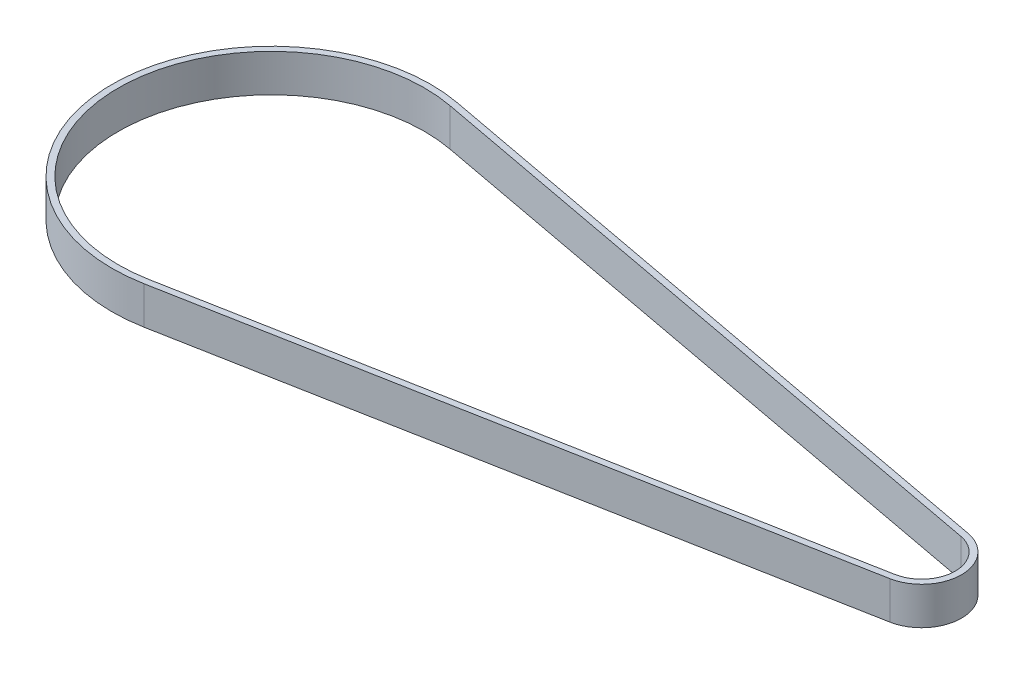
ISO-10303-21;
HEADER;
FILE_DESCRIPTION(('STEP AP214'),'2;1');
FILE_NAME('part.step','',(''),(''),'','','');
FILE_SCHEMA(('AUTOMOTIVE_DESIGN { 1 0 10303 214 1 1 1 1 }'));
ENDSEC;
DATA;
#1=APPLICATION_CONTEXT('core data for automotive mechanical design processes');
#2=APPLICATION_PROTOCOL_DEFINITION('international standard','automotive_design',2000,#1);
#3=PRODUCT_CONTEXT('',#1,'mechanical');
#4=PRODUCT('Part','Part','',(#3));
#5=PRODUCT_RELATED_PRODUCT_CATEGORY('part','',(#4));
#6=PRODUCT_DEFINITION_FORMATION('','',#4);
#7=PRODUCT_DEFINITION_CONTEXT('part definition',#1,'design');
#8=PRODUCT_DEFINITION('design','',#6,#7);
#9=PRODUCT_DEFINITION_SHAPE('','',#8);
#10=(LENGTH_UNIT() NAMED_UNIT(*) SI_UNIT(.MILLI.,.METRE.));
#11=(NAMED_UNIT(*) PLANE_ANGLE_UNIT() SI_UNIT($,.RADIAN.));
#12=(NAMED_UNIT(*) SI_UNIT($,.STERADIAN.) SOLID_ANGLE_UNIT());
#13=UNCERTAINTY_MEASURE_WITH_UNIT(LENGTH_MEASURE(1.E-05),#10,'distance_accuracy_value','');
#14=(GEOMETRIC_REPRESENTATION_CONTEXT(3) GLOBAL_UNCERTAINTY_ASSIGNED_CONTEXT((#13)) GLOBAL_UNIT_ASSIGNED_CONTEXT((#10,
#11,#12)) REPRESENTATION_CONTEXT('',''));
#15=CARTESIAN_POINT('',(0.,0.,0.));
#16=DIRECTION('',(0.,0.,1.));
#17=DIRECTION('',(1.,0.,0.));
#18=AXIS2_PLACEMENT_3D('',#15,#16,#17);
#19=CARTESIAN_POINT('',(0.,6.,0.));
#20=DIRECTION('',(0.,1.,0.));
#21=DIRECTION('',(0.,0.,1.));
#22=AXIS2_PLACEMENT_3D('',#19,#20,#21);
#23=PLANE('',#22);
#24=CARTESIAN_POINT('',(0.,6.,0.));
#25=DIRECTION('',(0.,1.,0.));
#26=DIRECTION('',(0.,0.,1.));
#27=AXIS2_PLACEMENT_3D('',#24,#25,#26);
#28=CIRCLE('',#27,25.4);
#29=CARTESIAN_POINT('',(4.66982060754861,6.,-24.9670337744257));
#30=VERTEX_POINT('',#29);
#31=CARTESIAN_POINT('',(4.66982060754861,6.,24.9670337744257));
#32=VERTEX_POINT('',#31);
#33=EDGE_CURVE('E138',#30,#32,#28,.T.);
#34=ORIENTED_EDGE('',*,*,#33,.T.);
#35=DIRECTION('',(0.982954085607312,0.,-0.183851205021599));
#36=VECTOR('',#35,1.);
#37=CARTESIAN_POINT('',(4.66982060754861,6.,24.9670337744257));
#38=LINE('',#37,#36);
#39=CARTESIAN_POINT('',(104.783855151887,6.,6.24175844360643));
#40=VERTEX_POINT('',#39);
#41=EDGE_CURVE('E141',#32,#40,#38,.T.);
#42=ORIENTED_EDGE('',*,*,#41,.T.);
#43=CARTESIAN_POINT('',(103.6164,6.,0.));
#44=DIRECTION('',(0.,1.,0.));
#45=DIRECTION('',(0.,0.,1.));
#46=AXIS2_PLACEMENT_3D('',#43,#44,#45);
#47=CIRCLE('',#46,6.35);
#48=CARTESIAN_POINT('',(104.783855151887,6.,-6.24175844360643));
#49=VERTEX_POINT('',#48);
#50=EDGE_CURVE('E144',#40,#49,#47,.T.);
#51=ORIENTED_EDGE('',*,*,#50,.T.);
#52=DIRECTION('',(-0.982954085607312,0.,-0.183851205021599));
#53=VECTOR('',#52,1.);
#54=CARTESIAN_POINT('',(4.66982060754861,6.,-24.9670337744257));
#55=LINE('',#54,#53);
#56=EDGE_CURVE('E146',#49,#30,#55,.T.);
#57=ORIENTED_EDGE('',*,*,#56,.T.);
#58=EDGE_LOOP('',(#34,#42,#51,#57));
#59=FACE_BOUND('',#58,.T.);
#60=DIRECTION('',(0.982954085607312,0.,-0.183851205021599));
#61=VECTOR('',#60,1.);
#62=CARTESIAN_POINT('',(4.48596940252701,6.,23.9840796888184));
#63=LINE('',#62,#61);
#64=CARTESIAN_POINT('',(4.48596940252701,6.,23.9840796888184));
#65=VERTEX_POINT('',#64);
#66=CARTESIAN_POINT('',(104.600003946866,6.,5.25880435799911));
#67=VERTEX_POINT('',#66);
#68=EDGE_CURVE('E110',#65,#67,#63,.T.);
#69=ORIENTED_EDGE('',*,*,#68,.F.);
#70=CARTESIAN_POINT('',(0.,6.,0.));
#71=DIRECTION('',(0.,1.,0.));
#72=DIRECTION('',(0.,0.,1.));
#73=AXIS2_PLACEMENT_3D('',#70,#71,#72);
#74=CIRCLE('',#73,24.4);
#75=CARTESIAN_POINT('',(4.48596940252701,6.,-23.9840796888184));
#76=VERTEX_POINT('',#75);
#77=EDGE_CURVE('E102',#76,#65,#74,.T.);
#78=ORIENTED_EDGE('',*,*,#77,.F.);
#79=DIRECTION('',(-0.982954085607312,0.,-0.183851205021599));
#80=VECTOR('',#79,1.);
#81=CARTESIAN_POINT('',(4.48596940252701,6.,-23.9840796888184));
#82=LINE('',#81,#80);
#83=CARTESIAN_POINT('',(104.600003946866,6.,-5.25880435799911));
#84=VERTEX_POINT('',#83);
#85=EDGE_CURVE('E124',#84,#76,#82,.T.);
#86=ORIENTED_EDGE('',*,*,#85,.F.);
#87=CARTESIAN_POINT('',(103.6164,6.,0.));
#88=DIRECTION('',(0.,1.,0.));
#89=DIRECTION('',(0.,0.,1.));
#90=AXIS2_PLACEMENT_3D('',#87,#88,#89);
#91=CIRCLE('',#90,5.34999999999999);
#92=EDGE_CURVE('E122',#67,#84,#91,.T.);
#93=ORIENTED_EDGE('',*,*,#92,.F.);
#94=EDGE_LOOP('',(#69,#78,#86,#93));
#95=FACE_BOUND('',#94,.T.);
#96=ADVANCED_FACE('F37',(#59,#95),#23,.T.);
#97=CARTESIAN_POINT('',(0.,0.,0.));
#98=DIRECTION('',(0.,1.,0.));
#99=DIRECTION('',(0.,0.,1.));
#100=AXIS2_PLACEMENT_3D('',#97,#98,#99);
#101=PLANE('',#100);
#102=CARTESIAN_POINT('',(0.,0.,0.));
#103=DIRECTION('',(0.,1.,0.));
#104=DIRECTION('',(0.,0.,1.));
#105=AXIS2_PLACEMENT_3D('',#102,#103,#104);
#106=CIRCLE('',#105,25.4);
#107=CARTESIAN_POINT('',(4.66982060754861,0.,-24.9670337744257));
#108=VERTEX_POINT('',#107);
#109=CARTESIAN_POINT('',(4.66982060754861,0.,24.9670337744257));
#110=VERTEX_POINT('',#109);
#111=EDGE_CURVE('E118',#108,#110,#106,.T.);
#112=ORIENTED_EDGE('',*,*,#111,.F.);
#113=DIRECTION('',(-0.982954085607312,0.,-0.183851205021599));
#114=VECTOR('',#113,1.);
#115=CARTESIAN_POINT('',(4.66982060754861,0.,-24.9670337744257));
#116=LINE('',#115,#114);
#117=CARTESIAN_POINT('',(104.783855151887,0.,-6.24175844360643));
#118=VERTEX_POINT('',#117);
#119=EDGE_CURVE('E142',#118,#108,#116,.T.);
#120=ORIENTED_EDGE('',*,*,#119,.F.);
#121=CARTESIAN_POINT('',(103.6164,0.,0.));
#122=DIRECTION('',(0.,1.,0.));
#123=DIRECTION('',(0.,0.,1.));
#124=AXIS2_PLACEMENT_3D('',#121,#122,#123);
#125=CIRCLE('',#124,6.35);
#126=CARTESIAN_POINT('',(104.783855151887,0.,6.24175844360643));
#127=VERTEX_POINT('',#126);
#128=EDGE_CURVE('E153',#127,#118,#125,.T.);
#129=ORIENTED_EDGE('',*,*,#128,.F.);
#130=DIRECTION('',(0.982954085607312,0.,-0.183851205021599));
#131=VECTOR('',#130,1.);
#132=CARTESIAN_POINT('',(4.66982060754861,0.,24.9670337744257));
#133=LINE('',#132,#131);
#134=EDGE_CURVE('E151',#110,#127,#133,.T.);
#135=ORIENTED_EDGE('',*,*,#134,.F.);
#136=EDGE_LOOP('',(#112,#120,#129,#135));
#137=FACE_BOUND('',#136,.T.);
#138=CARTESIAN_POINT('',(0.,0.,0.));
#139=DIRECTION('',(0.,1.,0.));
#140=DIRECTION('',(0.,0.,1.));
#141=AXIS2_PLACEMENT_3D('',#138,#139,#140);
#142=CIRCLE('',#141,24.4);
#143=CARTESIAN_POINT('',(4.48596940252701,0.,-23.9840796888184));
#144=VERTEX_POINT('',#143);
#145=CARTESIAN_POINT('',(4.48596940252701,0.,23.9840796888184));
#146=VERTEX_POINT('',#145);
#147=EDGE_CURVE('E60',#144,#146,#142,.T.);
#148=ORIENTED_EDGE('',*,*,#147,.T.);
#149=DIRECTION('',(0.982954085607312,0.,-0.183851205021599));
#150=VECTOR('',#149,1.);
#151=CARTESIAN_POINT('',(4.48596940252701,0.,23.9840796888184));
#152=LINE('',#151,#150);
#153=CARTESIAN_POINT('',(104.600003946866,0.,5.25880435799911));
#154=VERTEX_POINT('',#153);
#155=EDGE_CURVE('E117',#146,#154,#152,.T.);
#156=ORIENTED_EDGE('',*,*,#155,.T.);
#157=CARTESIAN_POINT('',(103.6164,0.,0.));
#158=DIRECTION('',(0.,1.,0.));
#159=DIRECTION('',(0.,0.,1.));
#160=AXIS2_PLACEMENT_3D('',#157,#158,#159);
#161=CIRCLE('',#160,5.34999999999999);
#162=CARTESIAN_POINT('',(104.600003946866,0.,-5.25880435799911));
#163=VERTEX_POINT('',#162);
#164=EDGE_CURVE('E130',#154,#163,#161,.T.);
#165=ORIENTED_EDGE('',*,*,#164,.T.);
#166=DIRECTION('',(-0.982954085607312,0.,-0.183851205021599));
#167=VECTOR('',#166,1.);
#168=CARTESIAN_POINT('',(4.48596940252701,0.,-23.9840796888184));
#169=LINE('',#168,#167);
#170=EDGE_CURVE('E111',#163,#144,#169,.T.);
#171=ORIENTED_EDGE('',*,*,#170,.T.);
#172=EDGE_LOOP('',(#148,#156,#165,#171));
#173=FACE_BOUND('',#172,.T.);
#174=ADVANCED_FACE('F171',(#137,#173),#101,.F.);
#175=CARTESIAN_POINT('',(0.,6.,0.));
#176=DIRECTION('',(0.,-1.,0.));
#177=DIRECTION('',(0.,0.,-1.));
#178=AXIS2_PLACEMENT_3D('',#175,#176,#177);
#179=CYLINDRICAL_SURFACE('',#178,25.4);
#180=ORIENTED_EDGE('',*,*,#111,.T.);
#181=DIRECTION('',(0.,-1.,0.));
#182=VECTOR('',#181,1.);
#183=CARTESIAN_POINT('',(4.66982060754861,6.,24.9670337744257));
#184=LINE('',#183,#182);
#185=EDGE_CURVE('E11',#32,#110,#184,.T.);
#186=ORIENTED_EDGE('',*,*,#185,.F.);
#187=ORIENTED_EDGE('',*,*,#33,.F.);
#188=DIRECTION('',(0.,-1.,0.));
#189=VECTOR('',#188,1.);
#190=CARTESIAN_POINT('',(4.66982060754861,6.,-24.9670337744257));
#191=LINE('',#190,#189);
#192=EDGE_CURVE('E148',#30,#108,#191,.T.);
#193=ORIENTED_EDGE('',*,*,#192,.T.);
#194=EDGE_LOOP('',(#180,#186,#187,#193));
#195=FACE_BOUND('',#194,.T.);
#196=ADVANCED_FACE('F39',(#195),#179,.T.);
#197=CARTESIAN_POINT('',(4.66982060754861,6.,24.9670337744257));
#198=DIRECTION('',(-0.183851205021599,0.,-0.982954085607312));
#199=DIRECTION('',(-0.982954085607312,0.,0.183851205021599));
#200=AXIS2_PLACEMENT_3D('',#197,#198,#199);
#201=PLANE('',#200);
#202=ORIENTED_EDGE('',*,*,#134,.T.);
#203=DIRECTION('',(0.,-1.,0.));
#204=VECTOR('',#203,1.);
#205=CARTESIAN_POINT('',(104.783855151887,6.,6.24175844360643));
#206=LINE('',#205,#204);
#207=EDGE_CURVE('E45',#40,#127,#206,.T.);
#208=ORIENTED_EDGE('',*,*,#207,.F.);
#209=ORIENTED_EDGE('',*,*,#41,.F.);
#210=ORIENTED_EDGE('',*,*,#185,.T.);
#211=EDGE_LOOP('',(#202,#208,#209,#210));
#212=FACE_BOUND('',#211,.T.);
#213=ADVANCED_FACE('F181',(#212),#201,.F.);
#214=CARTESIAN_POINT('',(103.6164,6.,0.));
#215=DIRECTION('',(0.,-1.,0.));
#216=DIRECTION('',(0.,0.,-1.));
#217=AXIS2_PLACEMENT_3D('',#214,#215,#216);
#218=CYLINDRICAL_SURFACE('',#217,6.35);
#219=ORIENTED_EDGE('',*,*,#128,.T.);
#220=DIRECTION('',(0.,-1.,0.));
#221=VECTOR('',#220,1.);
#222=CARTESIAN_POINT('',(104.783855151887,6.,-6.24175844360643));
#223=LINE('',#222,#221);
#224=EDGE_CURVE('E158',#49,#118,#223,.T.);
#225=ORIENTED_EDGE('',*,*,#224,.F.);
#226=ORIENTED_EDGE('',*,*,#50,.F.);
#227=ORIENTED_EDGE('',*,*,#207,.T.);
#228=EDGE_LOOP('',(#219,#225,#226,#227));
#229=FACE_BOUND('',#228,.T.);
#230=ADVANCED_FACE('F165',(#229),#218,.T.);
#231=CARTESIAN_POINT('',(4.66982060754861,6.,-24.9670337744257));
#232=DIRECTION('',(-0.183851205021599,0.,0.982954085607312));
#233=DIRECTION('',(0.982954085607312,0.,0.183851205021599));
#234=AXIS2_PLACEMENT_3D('',#231,#232,#233);
#235=PLANE('',#234);
#236=ORIENTED_EDGE('',*,*,#119,.T.);
#237=ORIENTED_EDGE('',*,*,#192,.F.);
#238=ORIENTED_EDGE('',*,*,#56,.F.);
#239=ORIENTED_EDGE('',*,*,#224,.T.);
#240=EDGE_LOOP('',(#236,#237,#238,#239));
#241=FACE_BOUND('',#240,.T.);
#242=ADVANCED_FACE('F175',(#241),#235,.F.);
#243=CARTESIAN_POINT('',(0.,6.,0.));
#244=DIRECTION('',(0.,-1.,0.));
#245=DIRECTION('',(0.,0.,-1.));
#246=AXIS2_PLACEMENT_3D('',#243,#244,#245);
#247=CYLINDRICAL_SURFACE('',#246,24.4);
#248=ORIENTED_EDGE('',*,*,#147,.F.);
#249=DIRECTION('',(0.,-1.,0.));
#250=VECTOR('',#249,1.);
#251=CARTESIAN_POINT('',(4.48596940252701,6.,-23.9840796888184));
#252=LINE('',#251,#250);
#253=EDGE_CURVE('E106',#76,#144,#252,.T.);
#254=ORIENTED_EDGE('',*,*,#253,.F.);
#255=ORIENTED_EDGE('',*,*,#77,.T.);
#256=DIRECTION('',(0.,-1.,0.));
#257=VECTOR('',#256,1.);
#258=CARTESIAN_POINT('',(4.48596940252701,6.,23.9840796888184));
#259=LINE('',#258,#257);
#260=EDGE_CURVE('E105',#65,#146,#259,.T.);
#261=ORIENTED_EDGE('',*,*,#260,.T.);
#262=EDGE_LOOP('',(#248,#254,#255,#261));
#263=FACE_BOUND('',#262,.T.);
#264=ADVANCED_FACE('F104',(#263),#247,.F.);
#265=CARTESIAN_POINT('',(4.48596940252701,6.,23.9840796888184));
#266=DIRECTION('',(-0.183851205021599,0.,-0.982954085607312));
#267=DIRECTION('',(-0.982954085607312,0.,0.183851205021599));
#268=AXIS2_PLACEMENT_3D('',#265,#266,#267);
#269=PLANE('',#268);
#270=ORIENTED_EDGE('',*,*,#155,.F.);
#271=ORIENTED_EDGE('',*,*,#260,.F.);
#272=ORIENTED_EDGE('',*,*,#68,.T.);
#273=DIRECTION('',(0.,-1.,0.));
#274=VECTOR('',#273,1.);
#275=CARTESIAN_POINT('',(104.600003946866,6.,5.25880435799911));
#276=LINE('',#275,#274);
#277=EDGE_CURVE('E119',#67,#154,#276,.T.);
#278=ORIENTED_EDGE('',*,*,#277,.T.);
#279=EDGE_LOOP('',(#270,#271,#272,#278));
#280=FACE_BOUND('',#279,.T.);
#281=ADVANCED_FACE('F114',(#280),#269,.T.);
#282=CARTESIAN_POINT('',(103.6164,6.,0.));
#283=DIRECTION('',(0.,-1.,0.));
#284=DIRECTION('',(0.,0.,-1.));
#285=AXIS2_PLACEMENT_3D('',#282,#283,#284);
#286=CYLINDRICAL_SURFACE('',#285,5.34999999999999);
#287=ORIENTED_EDGE('',*,*,#164,.F.);
#288=ORIENTED_EDGE('',*,*,#277,.F.);
#289=ORIENTED_EDGE('',*,*,#92,.T.);
#290=DIRECTION('',(0.,-1.,0.));
#291=VECTOR('',#290,1.);
#292=CARTESIAN_POINT('',(104.600003946866,6.,-5.25880435799911));
#293=LINE('',#292,#291);
#294=EDGE_CURVE('E52',#84,#163,#293,.T.);
#295=ORIENTED_EDGE('',*,*,#294,.T.);
#296=EDGE_LOOP('',(#287,#288,#289,#295));
#297=FACE_BOUND('',#296,.T.);
#298=ADVANCED_FACE('F204',(#297),#286,.F.);
#299=CARTESIAN_POINT('',(4.48596940252701,6.,-23.9840796888184));
#300=DIRECTION('',(-0.183851205021599,0.,0.982954085607312));
#301=DIRECTION('',(0.982954085607312,0.,0.183851205021599));
#302=AXIS2_PLACEMENT_3D('',#299,#300,#301);
#303=PLANE('',#302);
#304=ORIENTED_EDGE('',*,*,#170,.F.);
#305=ORIENTED_EDGE('',*,*,#294,.F.);
#306=ORIENTED_EDGE('',*,*,#85,.T.);
#307=ORIENTED_EDGE('',*,*,#253,.T.);
#308=EDGE_LOOP('',(#304,#305,#306,#307));
#309=FACE_BOUND('',#308,.T.);
#310=ADVANCED_FACE('F208',(#309),#303,.T.);
#311=CLOSED_SHELL('',(#96,#174,#196,#213,#230,#242,#264,#281,#298,#310));
#312=MANIFOLD_SOLID_BREP('B2',#311);
#313=ADVANCED_BREP_SHAPE_REPRESENTATION('',(#18,#312),#14);
#314=SHAPE_DEFINITION_REPRESENTATION(#9,#313);
ENDSEC;
END-ISO-10303-21;
